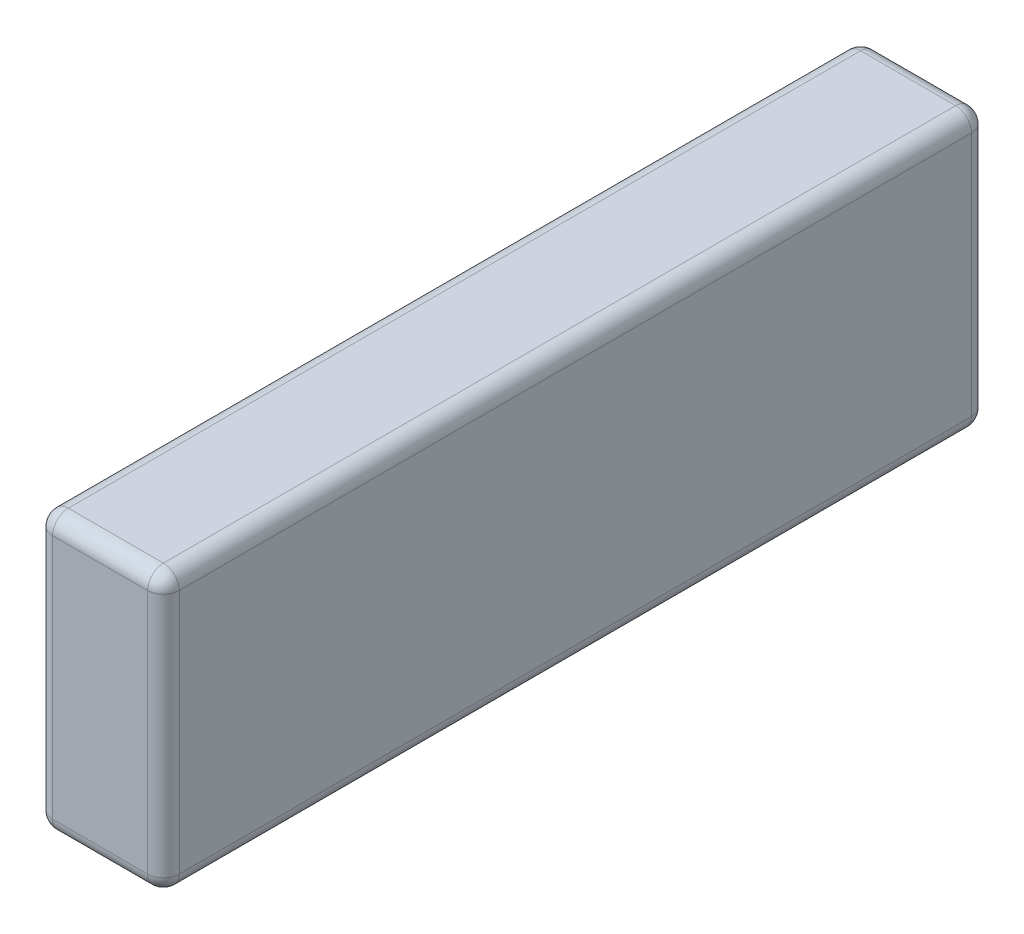
ISO-10303-21;
HEADER;
FILE_DESCRIPTION(('STEP AP214'),'2;1');
FILE_NAME('part.step','',(''),(''),'','','');
FILE_SCHEMA(('AUTOMOTIVE_DESIGN { 1 0 10303 214 1 1 1 1 }'));
ENDSEC;
DATA;
#1=APPLICATION_CONTEXT('core data for automotive mechanical design processes');
#2=APPLICATION_PROTOCOL_DEFINITION('international standard','automotive_design',2000,#1);
#3=PRODUCT_CONTEXT('',#1,'mechanical');
#4=PRODUCT('Part','Part','',(#3));
#5=PRODUCT_RELATED_PRODUCT_CATEGORY('part','',(#4));
#6=PRODUCT_DEFINITION_FORMATION('','',#4);
#7=PRODUCT_DEFINITION_CONTEXT('part definition',#1,'design');
#8=PRODUCT_DEFINITION('design','',#6,#7);
#9=PRODUCT_DEFINITION_SHAPE('','',#8);
#10=(LENGTH_UNIT() NAMED_UNIT(*) SI_UNIT(.MILLI.,.METRE.));
#11=(NAMED_UNIT(*) PLANE_ANGLE_UNIT() SI_UNIT($,.RADIAN.));
#12=(NAMED_UNIT(*) SI_UNIT($,.STERADIAN.) SOLID_ANGLE_UNIT());
#13=UNCERTAINTY_MEASURE_WITH_UNIT(LENGTH_MEASURE(1.E-05),#10,'distance_accuracy_value','');
#14=(GEOMETRIC_REPRESENTATION_CONTEXT(3) GLOBAL_UNCERTAINTY_ASSIGNED_CONTEXT((#13)) GLOBAL_UNIT_ASSIGNED_CONTEXT((#10,
#11,#12)) REPRESENTATION_CONTEXT('',''));
#15=CARTESIAN_POINT('',(0.,0.,0.));
#16=DIRECTION('',(0.,0.,1.));
#17=DIRECTION('',(1.,0.,0.));
#18=AXIS2_PLACEMENT_3D('',#15,#16,#17);
#19=CARTESIAN_POINT('',(8.,35.,52.));
#20=DIRECTION('',(-1.,0.,0.));
#21=DIRECTION('',(0.,0.,1.));
#22=AXIS2_PLACEMENT_3D('',#19,#20,#21);
#23=PLANE('',#22);
#24=DIRECTION('',(0.,0.,-1.));
#25=VECTOR('',#24,1.);
#26=CARTESIAN_POINT('',(8.,2.,-52.));
#27=LINE('',#26,#25);
#28=CARTESIAN_POINT('',(8.,2.,50.));
#29=VERTEX_POINT('',#28);
#30=CARTESIAN_POINT('',(8.,2.,-50.));
#31=VERTEX_POINT('',#30);
#32=EDGE_CURVE('E187',#29,#31,#27,.T.);
#33=ORIENTED_EDGE('',*,*,#32,.T.);
#34=DIRECTION('',(0.,-1.,0.));
#35=VECTOR('',#34,1.);
#36=CARTESIAN_POINT('',(8.,35.,-50.));
#37=LINE('',#36,#35);
#38=CARTESIAN_POINT('',(8.,33.,-50.));
#39=VERTEX_POINT('',#38);
#40=EDGE_CURVE('E189',#31,#39,#37,.F.);
#41=ORIENTED_EDGE('',*,*,#40,.T.);
#42=DIRECTION('',(0.,0.,-1.));
#43=VECTOR('',#42,1.);
#44=CARTESIAN_POINT('',(8.,33.,52.));
#45=LINE('',#44,#43);
#46=CARTESIAN_POINT('',(8.,33.,50.));
#47=VERTEX_POINT('',#46);
#48=EDGE_CURVE('E183',#39,#47,#45,.F.);
#49=ORIENTED_EDGE('',*,*,#48,.T.);
#50=DIRECTION('',(0.,-1.,0.));
#51=VECTOR('',#50,1.);
#52=CARTESIAN_POINT('',(8.,35.,50.));
#53=LINE('',#52,#51);
#54=EDGE_CURVE('E185',#47,#29,#53,.T.);
#55=ORIENTED_EDGE('',*,*,#54,.T.);
#56=EDGE_LOOP('',(#33,#41,#49,#55));
#57=FACE_BOUND('',#56,.T.);
#58=ADVANCED_FACE('F34',(#57),#23,.F.);
#59=CARTESIAN_POINT('',(-8.,35.,-52.));
#60=DIRECTION('',(0.,0.,1.));
#61=DIRECTION('',(1.,0.,0.));
#62=AXIS2_PLACEMENT_3D('',#59,#60,#61);
#63=PLANE('',#62);
#64=DIRECTION('',(-1.,0.,0.));
#65=VECTOR('',#64,1.);
#66=CARTESIAN_POINT('',(-8.,2.,-52.));
#67=LINE('',#66,#65);
#68=CARTESIAN_POINT('',(6.,2.,-52.));
#69=VERTEX_POINT('',#68);
#70=CARTESIAN_POINT('',(-6.,2.,-52.));
#71=VERTEX_POINT('',#70);
#72=EDGE_CURVE('E169',#69,#71,#67,.T.);
#73=ORIENTED_EDGE('',*,*,#72,.T.);
#74=DIRECTION('',(0.,-1.,0.));
#75=VECTOR('',#74,1.);
#76=CARTESIAN_POINT('',(-6.,35.,-52.));
#77=LINE('',#76,#75);
#78=CARTESIAN_POINT('',(-6.,33.,-52.));
#79=VERTEX_POINT('',#78);
#80=EDGE_CURVE('E171',#71,#79,#77,.F.);
#81=ORIENTED_EDGE('',*,*,#80,.T.);
#82=DIRECTION('',(-1.,0.,0.));
#83=VECTOR('',#82,1.);
#84=CARTESIAN_POINT('',(-8.,33.,-52.));
#85=LINE('',#84,#83);
#86=CARTESIAN_POINT('',(6.,33.,-52.));
#87=VERTEX_POINT('',#86);
#88=EDGE_CURVE('E165',#79,#87,#85,.F.);
#89=ORIENTED_EDGE('',*,*,#88,.T.);
#90=DIRECTION('',(0.,-1.,0.));
#91=VECTOR('',#90,1.);
#92=CARTESIAN_POINT('',(6.,35.,-52.));
#93=LINE('',#92,#91);
#94=EDGE_CURVE('E167',#87,#69,#93,.T.);
#95=ORIENTED_EDGE('',*,*,#94,.T.);
#96=EDGE_LOOP('',(#73,#81,#89,#95));
#97=FACE_BOUND('',#96,.T.);
#98=ADVANCED_FACE('F305',(#97),#63,.F.);
#99=CARTESIAN_POINT('',(-8.,35.,52.));
#100=DIRECTION('',(1.,0.,0.));
#101=DIRECTION('',(0.,0.,-1.));
#102=AXIS2_PLACEMENT_3D('',#99,#100,#101);
#103=PLANE('',#102);
#104=DIRECTION('',(0.,0.,1.));
#105=VECTOR('',#104,1.);
#106=CARTESIAN_POINT('',(-8.,33.,52.));
#107=LINE('',#106,#105);
#108=CARTESIAN_POINT('',(-8.,33.,50.));
#109=VERTEX_POINT('',#108);
#110=CARTESIAN_POINT('',(-8.,33.,-50.));
#111=VERTEX_POINT('',#110);
#112=EDGE_CURVE('E126',#109,#111,#107,.F.);
#113=ORIENTED_EDGE('',*,*,#112,.T.);
#114=DIRECTION('',(0.,-1.,0.));
#115=VECTOR('',#114,1.);
#116=CARTESIAN_POINT('',(-8.,35.,-50.));
#117=LINE('',#116,#115);
#118=CARTESIAN_POINT('',(-8.,2.,-50.));
#119=VERTEX_POINT('',#118);
#120=EDGE_CURVE('E163',#111,#119,#117,.T.);
#121=ORIENTED_EDGE('',*,*,#120,.T.);
#122=DIRECTION('',(0.,0.,1.));
#123=VECTOR('',#122,1.);
#124=CARTESIAN_POINT('',(-8.,2.,52.));
#125=LINE('',#124,#123);
#126=CARTESIAN_POINT('',(-8.,2.,50.));
#127=VERTEX_POINT('',#126);
#128=EDGE_CURVE('E129',#119,#127,#125,.T.);
#129=ORIENTED_EDGE('',*,*,#128,.T.);
#130=DIRECTION('',(0.,-1.,0.));
#131=VECTOR('',#130,1.);
#132=CARTESIAN_POINT('',(-8.,35.,50.));
#133=LINE('',#132,#131);
#134=EDGE_CURVE('E121',#127,#109,#133,.F.);
#135=ORIENTED_EDGE('',*,*,#134,.T.);
#136=EDGE_LOOP('',(#113,#121,#129,#135));
#137=FACE_BOUND('',#136,.T.);
#138=ADVANCED_FACE('F123',(#137),#103,.F.);
#139=CARTESIAN_POINT('',(-8.,35.,52.));
#140=DIRECTION('',(0.,0.,-1.));
#141=DIRECTION('',(-1.,0.,0.));
#142=AXIS2_PLACEMENT_3D('',#139,#140,#141);
#143=PLANE('',#142);
#144=DIRECTION('',(0.,-1.,0.));
#145=VECTOR('',#144,1.);
#146=CARTESIAN_POINT('',(-6.,35.,52.));
#147=LINE('',#146,#145);
#148=CARTESIAN_POINT('',(-6.,33.,52.));
#149=VERTEX_POINT('',#148);
#150=CARTESIAN_POINT('',(-6.,2.,52.));
#151=VERTEX_POINT('',#150);
#152=EDGE_CURVE('E140',#149,#151,#147,.T.);
#153=ORIENTED_EDGE('',*,*,#152,.T.);
#154=DIRECTION('',(1.,0.,0.));
#155=VECTOR('',#154,1.);
#156=CARTESIAN_POINT('',(8.,2.,52.));
#157=LINE('',#156,#155);
#158=CARTESIAN_POINT('',(6.,2.,52.));
#159=VERTEX_POINT('',#158);
#160=EDGE_CURVE('E197',#151,#159,#157,.T.);
#161=ORIENTED_EDGE('',*,*,#160,.T.);
#162=DIRECTION('',(0.,-1.,0.));
#163=VECTOR('',#162,1.);
#164=CARTESIAN_POINT('',(6.,35.,52.));
#165=LINE('',#164,#163);
#166=CARTESIAN_POINT('',(6.,33.,52.));
#167=VERTEX_POINT('',#166);
#168=EDGE_CURVE('E194',#159,#167,#165,.F.);
#169=ORIENTED_EDGE('',*,*,#168,.T.);
#170=DIRECTION('',(1.,0.,0.));
#171=VECTOR('',#170,1.);
#172=CARTESIAN_POINT('',(-8.,33.,52.));
#173=LINE('',#172,#171);
#174=EDGE_CURVE('E192',#167,#149,#173,.F.);
#175=ORIENTED_EDGE('',*,*,#174,.T.);
#176=EDGE_LOOP('',(#153,#161,#169,#175));
#177=FACE_BOUND('',#176,.T.);
#178=ADVANCED_FACE('F296',(#177),#143,.F.);
#179=CARTESIAN_POINT('',(0.,35.,0.));
#180=DIRECTION('',(0.,-1.,0.));
#181=DIRECTION('',(0.,0.,-1.));
#182=AXIS2_PLACEMENT_3D('',#179,#180,#181);
#183=PLANE('',#182);
#184=DIRECTION('',(0.,0.,1.));
#185=VECTOR('',#184,1.);
#186=CARTESIAN_POINT('',(-6.,35.,0.));
#187=LINE('',#186,#185);
#188=CARTESIAN_POINT('',(-6.,35.,-50.));
#189=VERTEX_POINT('',#188);
#190=CARTESIAN_POINT('',(-6.,35.,50.));
#191=VERTEX_POINT('',#190);
#192=EDGE_CURVE('E43',#189,#191,#187,.T.);
#193=ORIENTED_EDGE('',*,*,#192,.T.);
#194=DIRECTION('',(1.,0.,0.));
#195=VECTOR('',#194,1.);
#196=CARTESIAN_POINT('',(0.,35.,50.));
#197=LINE('',#196,#195);
#198=CARTESIAN_POINT('',(6.,35.,50.));
#199=VERTEX_POINT('',#198);
#200=EDGE_CURVE('E11',#191,#199,#197,.T.);
#201=ORIENTED_EDGE('',*,*,#200,.T.);
#202=DIRECTION('',(0.,0.,-1.));
#203=VECTOR('',#202,1.);
#204=CARTESIAN_POINT('',(6.,35.,0.));
#205=LINE('',#204,#203);
#206=CARTESIAN_POINT('',(6.,35.,-50.));
#207=VERTEX_POINT('',#206);
#208=EDGE_CURVE('E199',#199,#207,#205,.T.);
#209=ORIENTED_EDGE('',*,*,#208,.T.);
#210=DIRECTION('',(-1.,0.,0.));
#211=VECTOR('',#210,1.);
#212=CARTESIAN_POINT('',(0.,35.,-50.));
#213=LINE('',#212,#211);
#214=EDGE_CURVE('E54',#207,#189,#213,.T.);
#215=ORIENTED_EDGE('',*,*,#214,.T.);
#216=EDGE_LOOP('',(#193,#201,#209,#215));
#217=FACE_BOUND('',#216,.T.);
#218=ADVANCED_FACE('F298',(#217),#183,.F.);
#219=CARTESIAN_POINT('',(0.,0.,0.));
#220=DIRECTION('',(0.,-1.,0.));
#221=DIRECTION('',(0.,0.,-1.));
#222=AXIS2_PLACEMENT_3D('',#219,#220,#221);
#223=PLANE('',#222);
#224=DIRECTION('',(0.,0.,1.));
#225=VECTOR('',#224,1.);
#226=CARTESIAN_POINT('',(-6.,0.,-52.));
#227=LINE('',#226,#225);
#228=CARTESIAN_POINT('',(-6.,0.,50.));
#229=VERTEX_POINT('',#228);
#230=CARTESIAN_POINT('',(-6.,0.,-50.));
#231=VERTEX_POINT('',#230);
#232=EDGE_CURVE('E178',#229,#231,#227,.F.);
#233=ORIENTED_EDGE('',*,*,#232,.T.);
#234=DIRECTION('',(-1.,0.,0.));
#235=VECTOR('',#234,1.);
#236=CARTESIAN_POINT('',(8.,0.,-50.));
#237=LINE('',#236,#235);
#238=CARTESIAN_POINT('',(6.,0.,-50.));
#239=VERTEX_POINT('',#238);
#240=EDGE_CURVE('E180',#231,#239,#237,.F.);
#241=ORIENTED_EDGE('',*,*,#240,.T.);
#242=DIRECTION('',(0.,0.,-1.));
#243=VECTOR('',#242,1.);
#244=CARTESIAN_POINT('',(6.,0.,52.));
#245=LINE('',#244,#243);
#246=CARTESIAN_POINT('',(6.,0.,50.));
#247=VERTEX_POINT('',#246);
#248=EDGE_CURVE('E176',#239,#247,#245,.F.);
#249=ORIENTED_EDGE('',*,*,#248,.T.);
#250=DIRECTION('',(1.,0.,0.));
#251=VECTOR('',#250,1.);
#252=CARTESIAN_POINT('',(-8.,0.,50.));
#253=LINE('',#252,#251);
#254=EDGE_CURVE('E174',#247,#229,#253,.F.);
#255=ORIENTED_EDGE('',*,*,#254,.T.);
#256=EDGE_LOOP('',(#233,#241,#249,#255));
#257=FACE_BOUND('',#256,.T.);
#258=ADVANCED_FACE('F266',(#257),#223,.T.);
#259=CARTESIAN_POINT('',(6.,35.,50.));
#260=DIRECTION('',(0.,-1.,0.));
#261=DIRECTION('',(0.,0.,-1.));
#262=AXIS2_PLACEMENT_3D('',#259,#260,#261);
#263=CYLINDRICAL_SURFACE('',#262,2.);
#264=CARTESIAN_POINT('',(6.,33.,50.));
#265=DIRECTION('',(0.,1.,0.));
#266=DIRECTION('',(0.,0.,1.));
#267=AXIS2_PLACEMENT_3D('',#264,#265,#266);
#268=CIRCLE('',#267,2.);
#269=EDGE_CURVE('E38',#167,#47,#268,.T.);
#270=ORIENTED_EDGE('',*,*,#269,.F.);
#271=ORIENTED_EDGE('',*,*,#168,.F.);
#272=CARTESIAN_POINT('',(6.,2.,50.));
#273=DIRECTION('',(0.,-1.,0.));
#274=DIRECTION('',(0.,0.,-1.));
#275=AXIS2_PLACEMENT_3D('',#272,#273,#274);
#276=CIRCLE('',#275,2.);
#277=EDGE_CURVE('E160',#29,#159,#276,.T.);
#278=ORIENTED_EDGE('',*,*,#277,.F.);
#279=ORIENTED_EDGE('',*,*,#54,.F.);
#280=EDGE_LOOP('',(#270,#271,#278,#279));
#281=FACE_BOUND('',#280,.T.);
#282=ADVANCED_FACE('F36',(#281),#263,.T.);
#283=CARTESIAN_POINT('',(6.,33.,50.));
#284=DIRECTION('',(1.,0.,0.));
#285=DIRECTION('',(0.,0.,-1.));
#286=AXIS2_PLACEMENT_3D('',#283,#284,#285);
#287=SPHERICAL_SURFACE('',#286,2.);
#288=CARTESIAN_POINT('',(6.,33.,50.));
#289=DIRECTION('',(1.,0.,0.));
#290=DIRECTION('',(0.,0.,-1.));
#291=AXIS2_PLACEMENT_3D('',#288,#289,#290);
#292=CIRCLE('',#291,2.);
#293=EDGE_CURVE('E244',#167,#199,#292,.F.);
#294=ORIENTED_EDGE('',*,*,#293,.F.);
#295=ORIENTED_EDGE('',*,*,#269,.T.);
#296=CARTESIAN_POINT('',(6.,33.,50.));
#297=DIRECTION('',(0.,0.,1.));
#298=DIRECTION('',(1.,0.,0.));
#299=AXIS2_PLACEMENT_3D('',#296,#297,#298);
#300=CIRCLE('',#299,2.);
#301=EDGE_CURVE('E247',#199,#47,#300,.F.);
#302=ORIENTED_EDGE('',*,*,#301,.F.);
#303=EDGE_LOOP('',(#294,#295,#302));
#304=FACE_BOUND('',#303,.T.);
#305=ADVANCED_FACE('F291',(#304),#287,.T.);
#306=CARTESIAN_POINT('',(6.,2.,50.));
#307=DIRECTION('',(0.,0.,1.));
#308=DIRECTION('',(0.,-1.,0.));
#309=AXIS2_PLACEMENT_3D('',#306,#307,#308);
#310=SPHERICAL_SURFACE('',#309,2.);
#311=CARTESIAN_POINT('',(6.,2.,50.));
#312=DIRECTION('',(0.,0.,1.));
#313=DIRECTION('',(1.,0.,0.));
#314=AXIS2_PLACEMENT_3D('',#311,#312,#313);
#315=CIRCLE('',#314,2.);
#316=EDGE_CURVE('E238',#29,#247,#315,.F.);
#317=ORIENTED_EDGE('',*,*,#316,.F.);
#318=ORIENTED_EDGE('',*,*,#277,.T.);
#319=CARTESIAN_POINT('',(6.,2.,50.));
#320=DIRECTION('',(1.,0.,0.));
#321=DIRECTION('',(0.,0.,-1.));
#322=AXIS2_PLACEMENT_3D('',#319,#320,#321);
#323=CIRCLE('',#322,2.);
#324=EDGE_CURVE('E241',#247,#159,#323,.F.);
#325=ORIENTED_EDGE('',*,*,#324,.F.);
#326=EDGE_LOOP('',(#317,#318,#325));
#327=FACE_BOUND('',#326,.T.);
#328=ADVANCED_FACE('F254',(#327),#310,.T.);
#329=CARTESIAN_POINT('',(6.,33.,0.));
#330=DIRECTION('',(0.,0.,-1.));
#331=DIRECTION('',(-1.,0.,0.));
#332=AXIS2_PLACEMENT_3D('',#329,#330,#331);
#333=CYLINDRICAL_SURFACE('',#332,2.);
#334=ORIENTED_EDGE('',*,*,#301,.T.);
#335=ORIENTED_EDGE('',*,*,#48,.F.);
#336=CARTESIAN_POINT('',(6.,33.,-50.));
#337=DIRECTION('',(0.,0.,-1.));
#338=DIRECTION('',(-1.,0.,0.));
#339=AXIS2_PLACEMENT_3D('',#336,#337,#338);
#340=CIRCLE('',#339,2.);
#341=EDGE_CURVE('E233',#207,#39,#340,.T.);
#342=ORIENTED_EDGE('',*,*,#341,.F.);
#343=ORIENTED_EDGE('',*,*,#208,.F.);
#344=EDGE_LOOP('',(#334,#335,#342,#343));
#345=FACE_BOUND('',#344,.T.);
#346=ADVANCED_FACE('F286',(#345),#333,.T.);
#347=CARTESIAN_POINT('',(0.,33.,50.));
#348=DIRECTION('',(1.,0.,0.));
#349=DIRECTION('',(0.,0.,-1.));
#350=AXIS2_PLACEMENT_3D('',#347,#348,#349);
#351=CYLINDRICAL_SURFACE('',#350,2.);
#352=ORIENTED_EDGE('',*,*,#293,.T.);
#353=ORIENTED_EDGE('',*,*,#200,.F.);
#354=CARTESIAN_POINT('',(-6.,33.,50.));
#355=DIRECTION('',(-1.,0.,0.));
#356=DIRECTION('',(0.,0.,1.));
#357=AXIS2_PLACEMENT_3D('',#354,#355,#356);
#358=CIRCLE('',#357,2.);
#359=EDGE_CURVE('E144',#149,#191,#358,.T.);
#360=ORIENTED_EDGE('',*,*,#359,.F.);
#361=ORIENTED_EDGE('',*,*,#174,.F.);
#362=EDGE_LOOP('',(#352,#353,#360,#361));
#363=FACE_BOUND('',#362,.T.);
#364=ADVANCED_FACE('F294',(#363),#351,.T.);
#365=CARTESIAN_POINT('',(-6.,35.,50.));
#366=DIRECTION('',(0.,-1.,0.));
#367=DIRECTION('',(0.,0.,-1.));
#368=AXIS2_PLACEMENT_3D('',#365,#366,#367);
#369=CYLINDRICAL_SURFACE('',#368,2.);
#370=CARTESIAN_POINT('',(-6.,2.,50.));
#371=DIRECTION('',(0.,-1.,0.));
#372=DIRECTION('',(0.,0.,-1.));
#373=AXIS2_PLACEMENT_3D('',#370,#371,#372);
#374=CIRCLE('',#373,2.);
#375=EDGE_CURVE('E145',#151,#127,#374,.T.);
#376=ORIENTED_EDGE('',*,*,#375,.F.);
#377=ORIENTED_EDGE('',*,*,#152,.F.);
#378=CARTESIAN_POINT('',(-6.,33.,50.));
#379=DIRECTION('',(0.,1.,0.));
#380=DIRECTION('',(0.,0.,1.));
#381=AXIS2_PLACEMENT_3D('',#378,#379,#380);
#382=CIRCLE('',#381,2.);
#383=EDGE_CURVE('E136',#109,#149,#382,.T.);
#384=ORIENTED_EDGE('',*,*,#383,.F.);
#385=ORIENTED_EDGE('',*,*,#134,.F.);
#386=EDGE_LOOP('',(#376,#377,#384,#385));
#387=FACE_BOUND('',#386,.T.);
#388=ADVANCED_FACE('F138',(#387),#369,.T.);
#389=CARTESIAN_POINT('',(-8.,2.,50.));
#390=DIRECTION('',(-1.,0.,0.));
#391=DIRECTION('',(0.,0.,1.));
#392=AXIS2_PLACEMENT_3D('',#389,#390,#391);
#393=CYLINDRICAL_SURFACE('',#392,2.);
#394=ORIENTED_EDGE('',*,*,#324,.T.);
#395=ORIENTED_EDGE('',*,*,#160,.F.);
#396=CARTESIAN_POINT('',(-6.,2.,50.));
#397=DIRECTION('',(-1.,0.,0.));
#398=DIRECTION('',(0.,0.,1.));
#399=AXIS2_PLACEMENT_3D('',#396,#397,#398);
#400=CIRCLE('',#399,2.);
#401=EDGE_CURVE('E229',#229,#151,#400,.T.);
#402=ORIENTED_EDGE('',*,*,#401,.F.);
#403=ORIENTED_EDGE('',*,*,#254,.F.);
#404=EDGE_LOOP('',(#394,#395,#402,#403));
#405=FACE_BOUND('',#404,.T.);
#406=ADVANCED_FACE('F262',(#405),#393,.T.);
#407=CARTESIAN_POINT('',(6.,2.,52.));
#408=DIRECTION('',(0.,0.,1.));
#409=DIRECTION('',(1.,0.,0.));
#410=AXIS2_PLACEMENT_3D('',#407,#408,#409);
#411=CYLINDRICAL_SURFACE('',#410,2.);
#412=ORIENTED_EDGE('',*,*,#316,.T.);
#413=ORIENTED_EDGE('',*,*,#248,.F.);
#414=CARTESIAN_POINT('',(6.,2.,-50.));
#415=DIRECTION('',(0.,0.,-1.));
#416=DIRECTION('',(-1.,0.,0.));
#417=AXIS2_PLACEMENT_3D('',#414,#415,#416);
#418=CIRCLE('',#417,2.);
#419=EDGE_CURVE('E226',#31,#239,#418,.T.);
#420=ORIENTED_EDGE('',*,*,#419,.F.);
#421=ORIENTED_EDGE('',*,*,#32,.F.);
#422=EDGE_LOOP('',(#412,#413,#420,#421));
#423=FACE_BOUND('',#422,.T.);
#424=ADVANCED_FACE('F272',(#423),#411,.T.);
#425=CARTESIAN_POINT('',(6.,35.,-50.));
#426=DIRECTION('',(0.,-1.,0.));
#427=DIRECTION('',(0.,0.,-1.));
#428=AXIS2_PLACEMENT_3D('',#425,#426,#427);
#429=CYLINDRICAL_SURFACE('',#428,2.);
#430=CARTESIAN_POINT('',(6.,33.,-50.));
#431=DIRECTION('',(0.,1.,0.));
#432=DIRECTION('',(0.,0.,1.));
#433=AXIS2_PLACEMENT_3D('',#430,#431,#432);
#434=CIRCLE('',#433,2.);
#435=EDGE_CURVE('E235',#39,#87,#434,.T.);
#436=ORIENTED_EDGE('',*,*,#435,.F.);
#437=ORIENTED_EDGE('',*,*,#40,.F.);
#438=CARTESIAN_POINT('',(6.,2.,-50.));
#439=DIRECTION('',(0.,-1.,0.));
#440=DIRECTION('',(0.,0.,-1.));
#441=AXIS2_PLACEMENT_3D('',#438,#439,#440);
#442=CIRCLE('',#441,2.);
#443=EDGE_CURVE('E223',#69,#31,#442,.T.);
#444=ORIENTED_EDGE('',*,*,#443,.F.);
#445=ORIENTED_EDGE('',*,*,#94,.F.);
#446=EDGE_LOOP('',(#436,#437,#444,#445));
#447=FACE_BOUND('',#446,.T.);
#448=ADVANCED_FACE('F278',(#447),#429,.T.);
#449=CARTESIAN_POINT('',(6.,33.,-50.));
#450=DIRECTION('',(1.,0.,0.));
#451=DIRECTION('',(0.,0.,-1.));
#452=AXIS2_PLACEMENT_3D('',#449,#450,#451);
#453=SPHERICAL_SURFACE('',#452,2.);
#454=ORIENTED_EDGE('',*,*,#341,.T.);
#455=ORIENTED_EDGE('',*,*,#435,.T.);
#456=CARTESIAN_POINT('',(6.,33.,-50.));
#457=DIRECTION('',(1.,0.,0.));
#458=DIRECTION('',(0.,0.,-1.));
#459=AXIS2_PLACEMENT_3D('',#456,#457,#458);
#460=CIRCLE('',#459,2.);
#461=EDGE_CURVE('E151',#207,#87,#460,.F.);
#462=ORIENTED_EDGE('',*,*,#461,.F.);
#463=EDGE_LOOP('',(#454,#455,#462));
#464=FACE_BOUND('',#463,.T.);
#465=ADVANCED_FACE('F352',(#464),#453,.T.);
#466=CARTESIAN_POINT('',(-6.,33.,50.));
#467=DIRECTION('',(0.,0.,1.));
#468=DIRECTION('',(1.,0.,0.));
#469=AXIS2_PLACEMENT_3D('',#466,#467,#468);
#470=SPHERICAL_SURFACE('',#469,2.);
#471=ORIENTED_EDGE('',*,*,#383,.T.);
#472=ORIENTED_EDGE('',*,*,#359,.T.);
#473=CARTESIAN_POINT('',(-6.,33.,50.));
#474=DIRECTION('',(0.,0.,1.));
#475=DIRECTION('',(1.,0.,0.));
#476=AXIS2_PLACEMENT_3D('',#473,#474,#475);
#477=CIRCLE('',#476,2.);
#478=EDGE_CURVE('E148',#109,#191,#477,.F.);
#479=ORIENTED_EDGE('',*,*,#478,.F.);
#480=EDGE_LOOP('',(#471,#472,#479));
#481=FACE_BOUND('',#480,.T.);
#482=ADVANCED_FACE('F149',(#481),#470,.T.);
#483=CARTESIAN_POINT('',(-6.,2.,50.));
#484=DIRECTION('',(0.,0.,1.));
#485=DIRECTION('',(0.,-1.,0.));
#486=AXIS2_PLACEMENT_3D('',#483,#484,#485);
#487=SPHERICAL_SURFACE('',#486,2.);
#488=ORIENTED_EDGE('',*,*,#401,.T.);
#489=ORIENTED_EDGE('',*,*,#375,.T.);
#490=CARTESIAN_POINT('',(-6.,2.,50.));
#491=DIRECTION('',(0.,0.,1.));
#492=DIRECTION('',(1.,0.,0.));
#493=AXIS2_PLACEMENT_3D('',#490,#491,#492);
#494=CIRCLE('',#493,2.);
#495=EDGE_CURVE('E152',#229,#127,#494,.F.);
#496=ORIENTED_EDGE('',*,*,#495,.F.);
#497=EDGE_LOOP('',(#488,#489,#496));
#498=FACE_BOUND('',#497,.T.);
#499=ADVANCED_FACE('F345',(#498),#487,.T.);
#500=CARTESIAN_POINT('',(6.,2.,-50.));
#501=DIRECTION('',(1.,0.,0.));
#502=DIRECTION('',(0.,1.,0.));
#503=AXIS2_PLACEMENT_3D('',#500,#501,#502);
#504=SPHERICAL_SURFACE('',#503,2.);
#505=ORIENTED_EDGE('',*,*,#443,.T.);
#506=ORIENTED_EDGE('',*,*,#419,.T.);
#507=CARTESIAN_POINT('',(6.,2.,-50.));
#508=DIRECTION('',(1.,0.,0.));
#509=DIRECTION('',(0.,0.,-1.));
#510=AXIS2_PLACEMENT_3D('',#507,#508,#509);
#511=CIRCLE('',#510,2.);
#512=EDGE_CURVE('E217',#69,#239,#511,.F.);
#513=ORIENTED_EDGE('',*,*,#512,.F.);
#514=EDGE_LOOP('',(#505,#506,#513));
#515=FACE_BOUND('',#514,.T.);
#516=ADVANCED_FACE('F341',(#515),#504,.T.);
#517=CARTESIAN_POINT('',(0.,33.,-50.));
#518=DIRECTION('',(-1.,0.,0.));
#519=DIRECTION('',(0.,0.,1.));
#520=AXIS2_PLACEMENT_3D('',#517,#518,#519);
#521=CYLINDRICAL_SURFACE('',#520,2.);
#522=ORIENTED_EDGE('',*,*,#461,.T.);
#523=ORIENTED_EDGE('',*,*,#88,.F.);
#524=CARTESIAN_POINT('',(-6.,33.,-50.));
#525=DIRECTION('',(-1.,0.,0.));
#526=DIRECTION('',(0.,0.,1.));
#527=AXIS2_PLACEMENT_3D('',#524,#525,#526);
#528=CIRCLE('',#527,2.);
#529=EDGE_CURVE('E214',#189,#79,#528,.T.);
#530=ORIENTED_EDGE('',*,*,#529,.F.);
#531=ORIENTED_EDGE('',*,*,#214,.F.);
#532=EDGE_LOOP('',(#522,#523,#530,#531));
#533=FACE_BOUND('',#532,.T.);
#534=ADVANCED_FACE('F338',(#533),#521,.T.);
#535=CARTESIAN_POINT('',(-6.,33.,0.));
#536=DIRECTION('',(0.,0.,1.));
#537=DIRECTION('',(1.,0.,0.));
#538=AXIS2_PLACEMENT_3D('',#535,#536,#537);
#539=CYLINDRICAL_SURFACE('',#538,2.);
#540=ORIENTED_EDGE('',*,*,#478,.T.);
#541=ORIENTED_EDGE('',*,*,#192,.F.);
#542=CARTESIAN_POINT('',(-6.,33.,-50.));
#543=DIRECTION('',(0.,0.,-1.));
#544=DIRECTION('',(-1.,0.,0.));
#545=AXIS2_PLACEMENT_3D('',#542,#543,#544);
#546=CIRCLE('',#545,2.);
#547=EDGE_CURVE('E156',#111,#189,#546,.T.);
#548=ORIENTED_EDGE('',*,*,#547,.F.);
#549=ORIENTED_EDGE('',*,*,#112,.F.);
#550=EDGE_LOOP('',(#540,#541,#548,#549));
#551=FACE_BOUND('',#550,.T.);
#552=ADVANCED_FACE('F154',(#551),#539,.T.);
#553=CARTESIAN_POINT('',(-6.,2.,52.));
#554=DIRECTION('',(0.,0.,-1.));
#555=DIRECTION('',(-1.,0.,0.));
#556=AXIS2_PLACEMENT_3D('',#553,#554,#555);
#557=CYLINDRICAL_SURFACE('',#556,2.);
#558=ORIENTED_EDGE('',*,*,#495,.T.);
#559=ORIENTED_EDGE('',*,*,#128,.F.);
#560=CARTESIAN_POINT('',(-6.,2.,-50.));
#561=DIRECTION('',(0.,0.,-1.));
#562=DIRECTION('',(-1.,0.,0.));
#563=AXIS2_PLACEMENT_3D('',#560,#561,#562);
#564=CIRCLE('',#563,2.);
#565=EDGE_CURVE('E210',#231,#119,#564,.T.);
#566=ORIENTED_EDGE('',*,*,#565,.F.);
#567=ORIENTED_EDGE('',*,*,#232,.F.);
#568=EDGE_LOOP('',(#558,#559,#566,#567));
#569=FACE_BOUND('',#568,.T.);
#570=ADVANCED_FACE('F331',(#569),#557,.T.);
#571=CARTESIAN_POINT('',(-8.,2.,-50.));
#572=DIRECTION('',(1.,0.,0.));
#573=DIRECTION('',(0.,0.,-1.));
#574=AXIS2_PLACEMENT_3D('',#571,#572,#573);
#575=CYLINDRICAL_SURFACE('',#574,2.);
#576=ORIENTED_EDGE('',*,*,#512,.T.);
#577=ORIENTED_EDGE('',*,*,#240,.F.);
#578=CARTESIAN_POINT('',(-6.,2.,-50.));
#579=DIRECTION('',(-1.,0.,0.));
#580=DIRECTION('',(0.,0.,1.));
#581=AXIS2_PLACEMENT_3D('',#578,#579,#580);
#582=CIRCLE('',#581,2.);
#583=EDGE_CURVE('E207',#71,#231,#582,.T.);
#584=ORIENTED_EDGE('',*,*,#583,.F.);
#585=ORIENTED_EDGE('',*,*,#72,.F.);
#586=EDGE_LOOP('',(#576,#577,#584,#585));
#587=FACE_BOUND('',#586,.T.);
#588=ADVANCED_FACE('F327',(#587),#575,.T.);
#589=CARTESIAN_POINT('',(-6.,33.,-50.));
#590=DIRECTION('',(0.,1.,0.));
#591=DIRECTION('',(0.,0.,1.));
#592=AXIS2_PLACEMENT_3D('',#589,#590,#591);
#593=SPHERICAL_SURFACE('',#592,2.);
#594=ORIENTED_EDGE('',*,*,#547,.T.);
#595=ORIENTED_EDGE('',*,*,#529,.T.);
#596=CARTESIAN_POINT('',(-6.,33.,-50.));
#597=DIRECTION('',(0.,1.,0.));
#598=DIRECTION('',(0.,0.,1.));
#599=AXIS2_PLACEMENT_3D('',#596,#597,#598);
#600=CIRCLE('',#599,2.);
#601=EDGE_CURVE('E205',#111,#79,#600,.F.);
#602=ORIENTED_EDGE('',*,*,#601,.F.);
#603=EDGE_LOOP('',(#594,#595,#602));
#604=FACE_BOUND('',#603,.T.);
#605=ADVANCED_FACE('F323',(#604),#593,.T.);
#606=CARTESIAN_POINT('',(-6.,2.,-50.));
#607=DIRECTION('',(0.,-1.,0.));
#608=DIRECTION('',(0.,0.,-1.));
#609=AXIS2_PLACEMENT_3D('',#606,#607,#608);
#610=SPHERICAL_SURFACE('',#609,2.);
#611=ORIENTED_EDGE('',*,*,#583,.T.);
#612=ORIENTED_EDGE('',*,*,#565,.T.);
#613=CARTESIAN_POINT('',(-6.,2.,-50.));
#614=DIRECTION('',(0.,-1.,0.));
#615=DIRECTION('',(0.,0.,-1.));
#616=AXIS2_PLACEMENT_3D('',#613,#614,#615);
#617=CIRCLE('',#616,2.);
#618=EDGE_CURVE('E203',#71,#119,#617,.F.);
#619=ORIENTED_EDGE('',*,*,#618,.F.);
#620=EDGE_LOOP('',(#611,#612,#619));
#621=FACE_BOUND('',#620,.T.);
#622=ADVANCED_FACE('F319',(#621),#610,.T.);
#623=CARTESIAN_POINT('',(-6.,35.,-50.));
#624=DIRECTION('',(0.,-1.,0.));
#625=DIRECTION('',(0.,0.,-1.));
#626=AXIS2_PLACEMENT_3D('',#623,#624,#625);
#627=CYLINDRICAL_SURFACE('',#626,2.);
#628=ORIENTED_EDGE('',*,*,#601,.T.);
#629=ORIENTED_EDGE('',*,*,#80,.F.);
#630=ORIENTED_EDGE('',*,*,#618,.T.);
#631=ORIENTED_EDGE('',*,*,#120,.F.);
#632=EDGE_LOOP('',(#628,#629,#630,#631));
#633=FACE_BOUND('',#632,.T.);
#634=ADVANCED_FACE('F316',(#633),#627,.T.);
#635=CLOSED_SHELL('',(#58,#98,#138,#178,#218,#258,#282,#305,#328,#346,#364,#388,#406,#424,#448,
#465,#482,#499,#516,#534,#552,#570,#588,#605,#622,#634));
#636=MANIFOLD_SOLID_BREP('B2',#635);
#637=ADVANCED_BREP_SHAPE_REPRESENTATION('',(#18,#636),#14);
#638=SHAPE_DEFINITION_REPRESENTATION(#9,#637);
ENDSEC;
END-ISO-10303-21;
